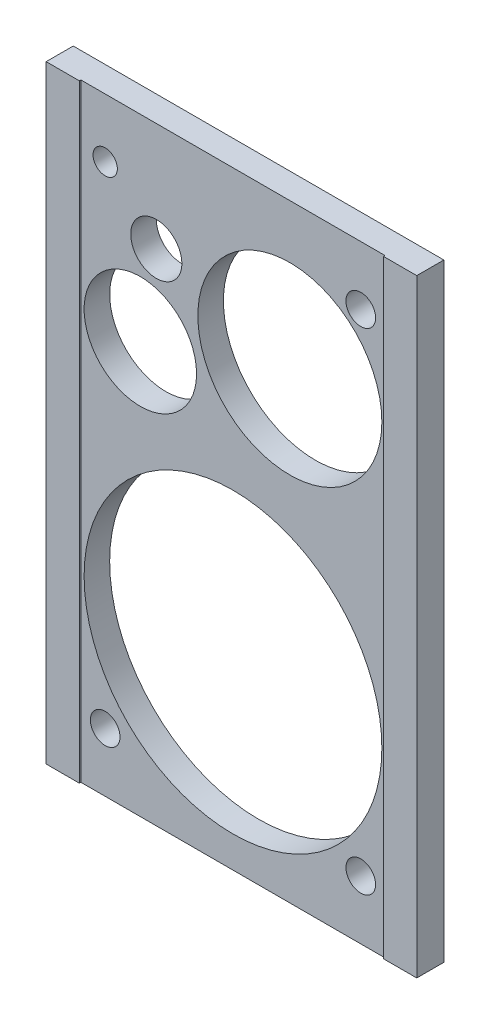
ISO-10303-21;
HEADER;
FILE_DESCRIPTION(('STEP AP214'),'2;1');
FILE_NAME('part.step','',(''),(''),'','','');
FILE_SCHEMA(('AUTOMOTIVE_DESIGN { 1 0 10303 214 1 1 1 1 }'));
ENDSEC;
DATA;
#1=APPLICATION_CONTEXT('core data for automotive mechanical design processes');
#2=APPLICATION_PROTOCOL_DEFINITION('international standard','automotive_design',2000,#1);
#3=PRODUCT_CONTEXT('',#1,'mechanical');
#4=PRODUCT('Part','Part','',(#3));
#5=PRODUCT_RELATED_PRODUCT_CATEGORY('part','',(#4));
#6=PRODUCT_DEFINITION_FORMATION('','',#4);
#7=PRODUCT_DEFINITION_CONTEXT('part definition',#1,'design');
#8=PRODUCT_DEFINITION('design','',#6,#7);
#9=PRODUCT_DEFINITION_SHAPE('','',#8);
#10=(LENGTH_UNIT() NAMED_UNIT(*) SI_UNIT(.MILLI.,.METRE.));
#11=(NAMED_UNIT(*) PLANE_ANGLE_UNIT() SI_UNIT($,.RADIAN.));
#12=(NAMED_UNIT(*) SI_UNIT($,.STERADIAN.) SOLID_ANGLE_UNIT());
#13=UNCERTAINTY_MEASURE_WITH_UNIT(LENGTH_MEASURE(1.E-05),#10,'distance_accuracy_value','');
#14=(GEOMETRIC_REPRESENTATION_CONTEXT(3) GLOBAL_UNCERTAINTY_ASSIGNED_CONTEXT((#13)) GLOBAL_UNIT_ASSIGNED_CONTEXT((#10,
#11,#12)) REPRESENTATION_CONTEXT('',''));
#15=CARTESIAN_POINT('',(0.,0.,0.));
#16=DIRECTION('',(0.,0.,1.));
#17=DIRECTION('',(1.,0.,0.));
#18=AXIS2_PLACEMENT_3D('',#15,#16,#17);
#19=CARTESIAN_POINT('',(0.,0.,10.));
#20=DIRECTION('',(0.,0.,1.));
#21=DIRECTION('',(1.,0.,0.));
#22=AXIS2_PLACEMENT_3D('',#19,#20,#21);
#23=PLANE('',#22);
#24=DIRECTION('',(0.,1.,0.));
#25=VECTOR('',#24,1.);
#26=CARTESIAN_POINT('',(59.5,0.,10.));
#27=LINE('',#26,#25);
#28=CARTESIAN_POINT('',(59.5,-119.,10.));
#29=VERTEX_POINT('',#28);
#30=CARTESIAN_POINT('',(59.5,119.,10.));
#31=VERTEX_POINT('',#30);
#32=EDGE_CURVE('E108',#29,#31,#27,.T.);
#33=ORIENTED_EDGE('',*,*,#32,.T.);
#34=DIRECTION('',(1.,0.,0.));
#35=VECTOR('',#34,1.);
#36=CARTESIAN_POINT('',(0.,119.,10.));
#37=LINE('',#36,#35);
#38=CARTESIAN_POINT('',(-59.5,119.,10.));
#39=VERTEX_POINT('',#38);
#40=EDGE_CURVE('E174',#39,#31,#37,.T.);
#41=ORIENTED_EDGE('',*,*,#40,.F.);
#42=DIRECTION('',(0.,-1.,0.));
#43=VECTOR('',#42,1.);
#44=CARTESIAN_POINT('',(-59.5,0.,10.));
#45=LINE('',#44,#43);
#46=CARTESIAN_POINT('',(-59.5,-119.,10.));
#47=VERTEX_POINT('',#46);
#48=EDGE_CURVE('E111',#39,#47,#45,.T.);
#49=ORIENTED_EDGE('',*,*,#48,.T.);
#50=DIRECTION('',(1.,0.,0.));
#51=VECTOR('',#50,1.);
#52=CARTESIAN_POINT('',(0.,-119.,10.));
#53=LINE('',#52,#51);
#54=EDGE_CURVE('E172',#47,#29,#53,.T.);
#55=ORIENTED_EDGE('',*,*,#54,.T.);
#56=EDGE_LOOP('',(#33,#41,#49,#55));
#57=FACE_BOUND('',#56,.T.);
#58=CARTESIAN_POINT('',(22.25,62.,10.));
#59=DIRECTION('',(0.,0.,1.));
#60=DIRECTION('',(1.,0.,0.));
#61=AXIS2_PLACEMENT_3D('',#58,#59,#60);
#62=CIRCLE('',#61,36.);
#63=CARTESIAN_POINT('',(58.25,62.,10.));
#64=VERTEX_POINT('',#63);
#65=EDGE_CURVE('E147',#64,#64,#62,.T.);
#66=ORIENTED_EDGE('',*,*,#65,.F.);
#67=EDGE_LOOP('',(#66));
#68=FACE_BOUND('',#67,.T.);
#69=CARTESIAN_POINT('',(-36.25,42.,10.));
#70=DIRECTION('',(0.,0.,1.));
#71=DIRECTION('',(1.,0.,0.));
#72=AXIS2_PLACEMENT_3D('',#69,#70,#71);
#73=CIRCLE('',#72,22.);
#74=CARTESIAN_POINT('',(-14.25,42.,10.));
#75=VERTEX_POINT('',#74);
#76=EDGE_CURVE('E150',#75,#75,#73,.T.);
#77=ORIENTED_EDGE('',*,*,#76,.F.);
#78=EDGE_LOOP('',(#77));
#79=FACE_BOUND('',#78,.T.);
#80=CARTESIAN_POINT('',(-50.,96.,10.));
#81=DIRECTION('',(0.,0.,1.));
#82=DIRECTION('',(1.,0.,0.));
#83=AXIS2_PLACEMENT_3D('',#80,#81,#82);
#84=CIRCLE('',#83,4.75);
#85=CARTESIAN_POINT('',(-45.25,96.,10.));
#86=VERTEX_POINT('',#85);
#87=EDGE_CURVE('E154',#86,#86,#84,.T.);
#88=ORIENTED_EDGE('',*,*,#87,.F.);
#89=EDGE_LOOP('',(#88));
#90=FACE_BOUND('',#89,.T.);
#91=CARTESIAN_POINT('',(-30.,76.5,10.));
#92=DIRECTION('',(0.,0.,1.));
#93=DIRECTION('',(1.,0.,0.));
#94=AXIS2_PLACEMENT_3D('',#91,#92,#93);
#95=CIRCLE('',#94,9.99999999999998);
#96=CARTESIAN_POINT('',(-20.,76.5,10.));
#97=VERTEX_POINT('',#96);
#98=EDGE_CURVE('E157',#97,#97,#95,.T.);
#99=ORIENTED_EDGE('',*,*,#98,.F.);
#100=EDGE_LOOP('',(#99));
#101=FACE_BOUND('',#100,.T.);
#102=CARTESIAN_POINT('',(0.,-48.5,10.));
#103=DIRECTION('',(0.,0.,1.));
#104=DIRECTION('',(1.,0.,0.));
#105=AXIS2_PLACEMENT_3D('',#102,#103,#104);
#106=CIRCLE('',#105,58.25);
#107=CARTESIAN_POINT('',(58.25,-48.5,10.));
#108=VERTEX_POINT('',#107);
#109=EDGE_CURVE('E160',#108,#108,#106,.T.);
#110=ORIENTED_EDGE('',*,*,#109,.F.);
#111=EDGE_LOOP('',(#110));
#112=FACE_BOUND('',#111,.T.);
#113=CARTESIAN_POINT('',(-50.,-96.,10.));
#114=DIRECTION('',(0.,0.,1.));
#115=DIRECTION('',(1.,0.,0.));
#116=AXIS2_PLACEMENT_3D('',#113,#114,#115);
#117=CIRCLE('',#116,5.8);
#118=CARTESIAN_POINT('',(-44.2,-96.,10.));
#119=VERTEX_POINT('',#118);
#120=EDGE_CURVE('E163',#119,#119,#117,.T.);
#121=ORIENTED_EDGE('',*,*,#120,.F.);
#122=EDGE_LOOP('',(#121));
#123=FACE_BOUND('',#122,.T.);
#124=CARTESIAN_POINT('',(50.,-96.,10.));
#125=DIRECTION('',(0.,0.,1.));
#126=DIRECTION('',(1.,0.,0.));
#127=AXIS2_PLACEMENT_3D('',#124,#125,#126);
#128=CIRCLE('',#127,5.8);
#129=CARTESIAN_POINT('',(55.8,-96.,10.));
#130=VERTEX_POINT('',#129);
#131=EDGE_CURVE('E166',#130,#130,#128,.T.);
#132=ORIENTED_EDGE('',*,*,#131,.F.);
#133=EDGE_LOOP('',(#132));
#134=FACE_BOUND('',#133,.T.);
#135=CARTESIAN_POINT('',(50.,96.,10.));
#136=DIRECTION('',(0.,0.,1.));
#137=DIRECTION('',(1.,0.,0.));
#138=AXIS2_PLACEMENT_3D('',#135,#136,#137);
#139=CIRCLE('',#138,5.8);
#140=CARTESIAN_POINT('',(55.8,96.,10.));
#141=VERTEX_POINT('',#140);
#142=EDGE_CURVE('E169',#141,#141,#139,.T.);
#143=ORIENTED_EDGE('',*,*,#142,.F.);
#144=EDGE_LOOP('',(#143));
#145=FACE_BOUND('',#144,.T.);
#146=ADVANCED_FACE('F34',(#57,#68,#79,#90,#101,#112,#123,#134,#145),#23,.T.);
#147=CARTESIAN_POINT('',(0.,-119.,10.));
#148=DIRECTION('',(0.,1.,0.));
#149=DIRECTION('',(0.,0.,1.));
#150=AXIS2_PLACEMENT_3D('',#147,#148,#149);
#151=PLANE('',#150);
#152=DIRECTION('',(1.,0.,0.));
#153=VECTOR('',#152,1.);
#154=CARTESIAN_POINT('',(0.,-119.,0.));
#155=LINE('',#154,#153);
#156=CARTESIAN_POINT('',(-72.5,-119.,0.));
#157=VERTEX_POINT('',#156);
#158=CARTESIAN_POINT('',(72.5,-119.,0.));
#159=VERTEX_POINT('',#158);
#160=EDGE_CURVE('E200',#157,#159,#155,.T.);
#161=ORIENTED_EDGE('',*,*,#160,.T.);
#162=DIRECTION('',(0.,0.,-1.));
#163=VECTOR('',#162,1.);
#164=CARTESIAN_POINT('',(72.5,-119.,10.));
#165=LINE('',#164,#163);
#166=CARTESIAN_POINT('',(72.5,-119.,10.6));
#167=VERTEX_POINT('',#166);
#168=EDGE_CURVE('E11',#167,#159,#165,.T.);
#169=ORIENTED_EDGE('',*,*,#168,.F.);
#170=DIRECTION('',(1.,0.,0.));
#171=VECTOR('',#170,1.);
#172=CARTESIAN_POINT('',(0.,-119.,10.6));
#173=LINE('',#172,#171);
#174=CARTESIAN_POINT('',(59.5,-119.,10.6));
#175=VERTEX_POINT('',#174);
#176=EDGE_CURVE('E115',#175,#167,#173,.T.);
#177=ORIENTED_EDGE('',*,*,#176,.F.);
#178=DIRECTION('',(0.,0.,-1.));
#179=VECTOR('',#178,1.);
#180=CARTESIAN_POINT('',(59.5,-119.,10.6));
#181=LINE('',#180,#179);
#182=EDGE_CURVE('E102',#175,#29,#181,.T.);
#183=ORIENTED_EDGE('',*,*,#182,.T.);
#184=ORIENTED_EDGE('',*,*,#54,.F.);
#185=DIRECTION('',(0.,0.,-1.));
#186=VECTOR('',#185,1.);
#187=CARTESIAN_POINT('',(-59.5,-119.,10.6));
#188=LINE('',#187,#186);
#189=CARTESIAN_POINT('',(-59.5,-119.,10.6));
#190=VERTEX_POINT('',#189);
#191=EDGE_CURVE('E49',#190,#47,#188,.T.);
#192=ORIENTED_EDGE('',*,*,#191,.F.);
#193=DIRECTION('',(1.,0.,0.));
#194=VECTOR('',#193,1.);
#195=CARTESIAN_POINT('',(0.,-119.,10.6));
#196=LINE('',#195,#194);
#197=CARTESIAN_POINT('',(-72.5,-119.,10.6));
#198=VERTEX_POINT('',#197);
#199=EDGE_CURVE('E140',#198,#190,#196,.T.);
#200=ORIENTED_EDGE('',*,*,#199,.F.);
#201=DIRECTION('',(0.,0.,-1.));
#202=VECTOR('',#201,1.);
#203=CARTESIAN_POINT('',(-72.5,-119.,10.));
#204=LINE('',#203,#202);
#205=EDGE_CURVE('E57',#198,#157,#204,.T.);
#206=ORIENTED_EDGE('',*,*,#205,.T.);
#207=EDGE_LOOP('',(#161,#169,#177,#183,#184,#192,#200,#206));
#208=FACE_BOUND('',#207,.T.);
#209=ADVANCED_FACE('F116',(#208),#151,.F.);
#210=CARTESIAN_POINT('',(72.5,0.,10.));
#211=DIRECTION('',(-1.,0.,0.));
#212=DIRECTION('',(0.,0.,1.));
#213=AXIS2_PLACEMENT_3D('',#210,#211,#212);
#214=PLANE('',#213);
#215=DIRECTION('',(0.,1.,0.));
#216=VECTOR('',#215,1.);
#217=CARTESIAN_POINT('',(72.5,0.,0.));
#218=LINE('',#217,#216);
#219=CARTESIAN_POINT('',(72.5,119.,0.));
#220=VERTEX_POINT('',#219);
#221=EDGE_CURVE('E202',#159,#220,#218,.T.);
#222=ORIENTED_EDGE('',*,*,#221,.T.);
#223=DIRECTION('',(0.,0.,-1.));
#224=VECTOR('',#223,1.);
#225=CARTESIAN_POINT('',(72.5,119.,10.));
#226=LINE('',#225,#224);
#227=CARTESIAN_POINT('',(72.5,119.,10.6));
#228=VERTEX_POINT('',#227);
#229=EDGE_CURVE('E42',#228,#220,#226,.T.);
#230=ORIENTED_EDGE('',*,*,#229,.F.);
#231=DIRECTION('',(0.,1.,0.));
#232=VECTOR('',#231,1.);
#233=CARTESIAN_POINT('',(72.5,0.,10.6));
#234=LINE('',#233,#232);
#235=EDGE_CURVE('E120',#167,#228,#234,.T.);
#236=ORIENTED_EDGE('',*,*,#235,.F.);
#237=ORIENTED_EDGE('',*,*,#168,.T.);
#238=EDGE_LOOP('',(#222,#230,#236,#237));
#239=FACE_BOUND('',#238,.T.);
#240=ADVANCED_FACE('F216',(#239),#214,.F.);
#241=CARTESIAN_POINT('',(0.,119.,10.));
#242=DIRECTION('',(0.,1.,0.));
#243=DIRECTION('',(0.,0.,1.));
#244=AXIS2_PLACEMENT_3D('',#241,#242,#243);
#245=PLANE('',#244);
#246=DIRECTION('',(1.,0.,0.));
#247=VECTOR('',#246,1.);
#248=CARTESIAN_POINT('',(0.,119.,0.));
#249=LINE('',#248,#247);
#250=CARTESIAN_POINT('',(-72.5,119.,0.));
#251=VERTEX_POINT('',#250);
#252=EDGE_CURVE('E205',#251,#220,#249,.T.);
#253=ORIENTED_EDGE('',*,*,#252,.F.);
#254=DIRECTION('',(0.,0.,-1.));
#255=VECTOR('',#254,1.);
#256=CARTESIAN_POINT('',(-72.5,119.,10.));
#257=LINE('',#256,#255);
#258=CARTESIAN_POINT('',(-72.5,119.,10.6));
#259=VERTEX_POINT('',#258);
#260=EDGE_CURVE('E211',#259,#251,#257,.T.);
#261=ORIENTED_EDGE('',*,*,#260,.F.);
#262=DIRECTION('',(-1.,0.,0.));
#263=VECTOR('',#262,1.);
#264=CARTESIAN_POINT('',(0.,119.,10.6));
#265=LINE('',#264,#263);
#266=CARTESIAN_POINT('',(-59.5,119.,10.6));
#267=VERTEX_POINT('',#266);
#268=EDGE_CURVE('E134',#267,#259,#265,.T.);
#269=ORIENTED_EDGE('',*,*,#268,.F.);
#270=DIRECTION('',(0.,0.,-1.));
#271=VECTOR('',#270,1.);
#272=CARTESIAN_POINT('',(-59.5,119.,10.6));
#273=LINE('',#272,#271);
#274=EDGE_CURVE('E144',#267,#39,#273,.T.);
#275=ORIENTED_EDGE('',*,*,#274,.T.);
#276=ORIENTED_EDGE('',*,*,#40,.T.);
#277=DIRECTION('',(0.,0.,-1.));
#278=VECTOR('',#277,1.);
#279=CARTESIAN_POINT('',(59.5,119.,10.6));
#280=LINE('',#279,#278);
#281=CARTESIAN_POINT('',(59.5,119.,10.6));
#282=VERTEX_POINT('',#281);
#283=EDGE_CURVE('E112',#282,#31,#280,.T.);
#284=ORIENTED_EDGE('',*,*,#283,.F.);
#285=DIRECTION('',(-1.,0.,0.));
#286=VECTOR('',#285,1.);
#287=CARTESIAN_POINT('',(0.,119.,10.6));
#288=LINE('',#287,#286);
#289=EDGE_CURVE('E124',#228,#282,#288,.T.);
#290=ORIENTED_EDGE('',*,*,#289,.F.);
#291=ORIENTED_EDGE('',*,*,#229,.T.);
#292=EDGE_LOOP('',(#253,#261,#269,#275,#276,#284,#290,#291));
#293=FACE_BOUND('',#292,.T.);
#294=ADVANCED_FACE('F214',(#293),#245,.T.);
#295=CARTESIAN_POINT('',(50.,96.,10.));
#296=DIRECTION('',(0.,0.,-1.));
#297=DIRECTION('',(-1.,0.,0.));
#298=AXIS2_PLACEMENT_3D('',#295,#296,#297);
#299=CYLINDRICAL_SURFACE('',#298,5.8);
#300=ORIENTED_EDGE('',*,*,#142,.T.);
#301=EDGE_LOOP('',(#300));
#302=FACE_BOUND('',#301,.T.);
#303=CARTESIAN_POINT('',(50.,96.,0.));
#304=DIRECTION('',(0.,0.,1.));
#305=DIRECTION('',(1.,0.,0.));
#306=AXIS2_PLACEMENT_3D('',#303,#304,#305);
#307=CIRCLE('',#306,5.8);
#308=CARTESIAN_POINT('',(55.8,96.,0.));
#309=VERTEX_POINT('',#308);
#310=EDGE_CURVE('E197',#309,#309,#307,.T.);
#311=ORIENTED_EDGE('',*,*,#310,.F.);
#312=EDGE_LOOP('',(#311));
#313=FACE_BOUND('',#312,.T.);
#314=ADVANCED_FACE('F249',(#302,#313),#299,.F.);
#315=CARTESIAN_POINT('',(50.,-96.,10.));
#316=DIRECTION('',(0.,0.,-1.));
#317=DIRECTION('',(-1.,0.,0.));
#318=AXIS2_PLACEMENT_3D('',#315,#316,#317);
#319=CYLINDRICAL_SURFACE('',#318,5.8);
#320=ORIENTED_EDGE('',*,*,#131,.T.);
#321=EDGE_LOOP('',(#320));
#322=FACE_BOUND('',#321,.T.);
#323=CARTESIAN_POINT('',(50.,-96.,0.));
#324=DIRECTION('',(0.,0.,1.));
#325=DIRECTION('',(1.,0.,0.));
#326=AXIS2_PLACEMENT_3D('',#323,#324,#325);
#327=CIRCLE('',#326,5.8);
#328=CARTESIAN_POINT('',(55.8,-96.,0.));
#329=VERTEX_POINT('',#328);
#330=EDGE_CURVE('E194',#329,#329,#327,.T.);
#331=ORIENTED_EDGE('',*,*,#330,.F.);
#332=EDGE_LOOP('',(#331));
#333=FACE_BOUND('',#332,.T.);
#334=ADVANCED_FACE('F252',(#322,#333),#319,.F.);
#335=CARTESIAN_POINT('',(-50.,-96.,10.));
#336=DIRECTION('',(0.,0.,-1.));
#337=DIRECTION('',(-1.,0.,0.));
#338=AXIS2_PLACEMENT_3D('',#335,#336,#337);
#339=CYLINDRICAL_SURFACE('',#338,5.8);
#340=ORIENTED_EDGE('',*,*,#120,.T.);
#341=EDGE_LOOP('',(#340));
#342=FACE_BOUND('',#341,.T.);
#343=CARTESIAN_POINT('',(-50.,-96.,0.));
#344=DIRECTION('',(0.,0.,1.));
#345=DIRECTION('',(1.,0.,0.));
#346=AXIS2_PLACEMENT_3D('',#343,#344,#345);
#347=CIRCLE('',#346,5.8);
#348=CARTESIAN_POINT('',(-44.2,-96.,0.));
#349=VERTEX_POINT('',#348);
#350=EDGE_CURVE('E191',#349,#349,#347,.T.);
#351=ORIENTED_EDGE('',*,*,#350,.F.);
#352=EDGE_LOOP('',(#351));
#353=FACE_BOUND('',#352,.T.);
#354=ADVANCED_FACE('F275',(#342,#353),#339,.F.);
#355=CARTESIAN_POINT('',(0.,-48.5,10.));
#356=DIRECTION('',(0.,0.,-1.));
#357=DIRECTION('',(-1.,0.,0.));
#358=AXIS2_PLACEMENT_3D('',#355,#356,#357);
#359=CYLINDRICAL_SURFACE('',#358,58.25);
#360=ORIENTED_EDGE('',*,*,#109,.T.);
#361=EDGE_LOOP('',(#360));
#362=FACE_BOUND('',#361,.T.);
#363=CARTESIAN_POINT('',(0.,-48.5,0.));
#364=DIRECTION('',(0.,0.,1.));
#365=DIRECTION('',(1.,0.,0.));
#366=AXIS2_PLACEMENT_3D('',#363,#364,#365);
#367=CIRCLE('',#366,58.25);
#368=CARTESIAN_POINT('',(58.25,-48.5,0.));
#369=VERTEX_POINT('',#368);
#370=EDGE_CURVE('E188',#369,#369,#367,.T.);
#371=ORIENTED_EDGE('',*,*,#370,.F.);
#372=EDGE_LOOP('',(#371));
#373=FACE_BOUND('',#372,.T.);
#374=ADVANCED_FACE('F279',(#362,#373),#359,.F.);
#375=CARTESIAN_POINT('',(-30.,76.5,10.));
#376=DIRECTION('',(0.,0.,-1.));
#377=DIRECTION('',(-1.,0.,0.));
#378=AXIS2_PLACEMENT_3D('',#375,#376,#377);
#379=CYLINDRICAL_SURFACE('',#378,9.99999999999998);
#380=ORIENTED_EDGE('',*,*,#98,.T.);
#381=EDGE_LOOP('',(#380));
#382=FACE_BOUND('',#381,.T.);
#383=CARTESIAN_POINT('',(-30.,76.5,0.));
#384=DIRECTION('',(0.,0.,1.));
#385=DIRECTION('',(1.,0.,0.));
#386=AXIS2_PLACEMENT_3D('',#383,#384,#385);
#387=CIRCLE('',#386,9.99999999999998);
#388=CARTESIAN_POINT('',(-20.,76.5,0.));
#389=VERTEX_POINT('',#388);
#390=EDGE_CURVE('E185',#389,#389,#387,.T.);
#391=ORIENTED_EDGE('',*,*,#390,.F.);
#392=EDGE_LOOP('',(#391));
#393=FACE_BOUND('',#392,.T.);
#394=ADVANCED_FACE('F283',(#382,#393),#379,.F.);
#395=CARTESIAN_POINT('',(-50.,96.,10.));
#396=DIRECTION('',(0.,0.,-1.));
#397=DIRECTION('',(-1.,0.,0.));
#398=AXIS2_PLACEMENT_3D('',#395,#396,#397);
#399=CYLINDRICAL_SURFACE('',#398,4.75);
#400=ORIENTED_EDGE('',*,*,#87,.T.);
#401=EDGE_LOOP('',(#400));
#402=FACE_BOUND('',#401,.T.);
#403=CARTESIAN_POINT('',(-50.,96.,0.));
#404=DIRECTION('',(0.,0.,1.));
#405=DIRECTION('',(1.,0.,0.));
#406=AXIS2_PLACEMENT_3D('',#403,#404,#405);
#407=CIRCLE('',#406,4.75);
#408=CARTESIAN_POINT('',(-45.25,96.,0.));
#409=VERTEX_POINT('',#408);
#410=EDGE_CURVE('E182',#409,#409,#407,.T.);
#411=ORIENTED_EDGE('',*,*,#410,.F.);
#412=EDGE_LOOP('',(#411));
#413=FACE_BOUND('',#412,.T.);
#414=ADVANCED_FACE('F287',(#402,#413),#399,.F.);
#415=CARTESIAN_POINT('',(-36.25,42.,10.));
#416=DIRECTION('',(0.,0.,-1.));
#417=DIRECTION('',(-1.,0.,0.));
#418=AXIS2_PLACEMENT_3D('',#415,#416,#417);
#419=CYLINDRICAL_SURFACE('',#418,22.);
#420=ORIENTED_EDGE('',*,*,#76,.T.);
#421=EDGE_LOOP('',(#420));
#422=FACE_BOUND('',#421,.T.);
#423=CARTESIAN_POINT('',(-36.25,42.,0.));
#424=DIRECTION('',(0.,0.,1.));
#425=DIRECTION('',(1.,0.,0.));
#426=AXIS2_PLACEMENT_3D('',#423,#424,#425);
#427=CIRCLE('',#426,22.);
#428=CARTESIAN_POINT('',(-14.25,42.,0.));
#429=VERTEX_POINT('',#428);
#430=EDGE_CURVE('E179',#429,#429,#427,.T.);
#431=ORIENTED_EDGE('',*,*,#430,.F.);
#432=EDGE_LOOP('',(#431));
#433=FACE_BOUND('',#432,.T.);
#434=ADVANCED_FACE('F290',(#422,#433),#419,.F.);
#435=CARTESIAN_POINT('',(22.25,62.,10.));
#436=DIRECTION('',(0.,0.,-1.));
#437=DIRECTION('',(-1.,0.,0.));
#438=AXIS2_PLACEMENT_3D('',#435,#436,#437);
#439=CYLINDRICAL_SURFACE('',#438,36.);
#440=ORIENTED_EDGE('',*,*,#65,.T.);
#441=EDGE_LOOP('',(#440));
#442=FACE_BOUND('',#441,.T.);
#443=CARTESIAN_POINT('',(22.25,62.,0.));
#444=DIRECTION('',(0.,0.,1.));
#445=DIRECTION('',(1.,0.,0.));
#446=AXIS2_PLACEMENT_3D('',#443,#444,#445);
#447=CIRCLE('',#446,36.);
#448=CARTESIAN_POINT('',(58.25,62.,0.));
#449=VERTEX_POINT('',#448);
#450=EDGE_CURVE('E146',#449,#449,#447,.T.);
#451=ORIENTED_EDGE('',*,*,#450,.F.);
#452=EDGE_LOOP('',(#451));
#453=FACE_BOUND('',#452,.T.);
#454=ADVANCED_FACE('F36',(#442,#453),#439,.F.);
#455=CARTESIAN_POINT('',(-72.5,0.,10.));
#456=DIRECTION('',(-1.,0.,0.));
#457=DIRECTION('',(0.,0.,1.));
#458=AXIS2_PLACEMENT_3D('',#455,#456,#457);
#459=PLANE('',#458);
#460=DIRECTION('',(0.,1.,0.));
#461=VECTOR('',#460,1.);
#462=CARTESIAN_POINT('',(-72.5,0.,0.));
#463=LINE('',#462,#461);
#464=EDGE_CURVE('E151',#157,#251,#463,.T.);
#465=ORIENTED_EDGE('',*,*,#464,.F.);
#466=ORIENTED_EDGE('',*,*,#205,.F.);
#467=DIRECTION('',(0.,-1.,0.));
#468=VECTOR('',#467,1.);
#469=CARTESIAN_POINT('',(-72.5,0.,10.6));
#470=LINE('',#469,#468);
#471=EDGE_CURVE('E137',#259,#198,#470,.T.);
#472=ORIENTED_EDGE('',*,*,#471,.F.);
#473=ORIENTED_EDGE('',*,*,#260,.T.);
#474=EDGE_LOOP('',(#465,#466,#472,#473));
#475=FACE_BOUND('',#474,.T.);
#476=ADVANCED_FACE('F221',(#475),#459,.T.);
#477=CARTESIAN_POINT('',(0.,0.,0.));
#478=DIRECTION('',(0.,0.,1.));
#479=DIRECTION('',(1.,0.,0.));
#480=AXIS2_PLACEMENT_3D('',#477,#478,#479);
#481=PLANE('',#480);
#482=ORIENTED_EDGE('',*,*,#450,.T.);
#483=EDGE_LOOP('',(#482));
#484=FACE_BOUND('',#483,.T.);
#485=ORIENTED_EDGE('',*,*,#430,.T.);
#486=EDGE_LOOP('',(#485));
#487=FACE_BOUND('',#486,.T.);
#488=ORIENTED_EDGE('',*,*,#410,.T.);
#489=EDGE_LOOP('',(#488));
#490=FACE_BOUND('',#489,.T.);
#491=ORIENTED_EDGE('',*,*,#390,.T.);
#492=EDGE_LOOP('',(#491));
#493=FACE_BOUND('',#492,.T.);
#494=ORIENTED_EDGE('',*,*,#370,.T.);
#495=EDGE_LOOP('',(#494));
#496=FACE_BOUND('',#495,.T.);
#497=ORIENTED_EDGE('',*,*,#350,.T.);
#498=EDGE_LOOP('',(#497));
#499=FACE_BOUND('',#498,.T.);
#500=ORIENTED_EDGE('',*,*,#330,.T.);
#501=EDGE_LOOP('',(#500));
#502=FACE_BOUND('',#501,.T.);
#503=ORIENTED_EDGE('',*,*,#310,.T.);
#504=EDGE_LOOP('',(#503));
#505=FACE_BOUND('',#504,.T.);
#506=ORIENTED_EDGE('',*,*,#160,.F.);
#507=ORIENTED_EDGE('',*,*,#464,.T.);
#508=ORIENTED_EDGE('',*,*,#252,.T.);
#509=ORIENTED_EDGE('',*,*,#221,.F.);
#510=EDGE_LOOP('',(#506,#507,#508,#509));
#511=FACE_BOUND('',#510,.T.);
#512=ADVANCED_FACE('F218',(#484,#487,#490,#493,#496,#499,#502,#505,#511),#481,.F.);
#513=CARTESIAN_POINT('',(-59.5,0.,10.6));
#514=DIRECTION('',(1.,0.,0.));
#515=DIRECTION('',(0.,1.,0.));
#516=AXIS2_PLACEMENT_3D('',#513,#514,#515);
#517=PLANE('',#516);
#518=ORIENTED_EDGE('',*,*,#48,.F.);
#519=ORIENTED_EDGE('',*,*,#274,.F.);
#520=DIRECTION('',(0.,-1.,0.));
#521=VECTOR('',#520,1.);
#522=CARTESIAN_POINT('',(-59.5,0.,10.6));
#523=LINE('',#522,#521);
#524=EDGE_CURVE('E132',#267,#190,#523,.T.);
#525=ORIENTED_EDGE('',*,*,#524,.T.);
#526=ORIENTED_EDGE('',*,*,#191,.T.);
#527=EDGE_LOOP('',(#518,#519,#525,#526));
#528=FACE_BOUND('',#527,.T.);
#529=ADVANCED_FACE('F227',(#528),#517,.T.);
#530=CARTESIAN_POINT('',(0.,0.,10.6));
#531=DIRECTION('',(0.,0.,1.));
#532=DIRECTION('',(1.,0.,0.));
#533=AXIS2_PLACEMENT_3D('',#530,#531,#532);
#534=PLANE('',#533);
#535=ORIENTED_EDGE('',*,*,#524,.F.);
#536=ORIENTED_EDGE('',*,*,#268,.T.);
#537=ORIENTED_EDGE('',*,*,#471,.T.);
#538=ORIENTED_EDGE('',*,*,#199,.T.);
#539=EDGE_LOOP('',(#535,#536,#537,#538));
#540=FACE_BOUND('',#539,.T.);
#541=ADVANCED_FACE('F226',(#540),#534,.T.);
#542=CARTESIAN_POINT('',(59.5,0.,10.6));
#543=DIRECTION('',(-1.,0.,0.));
#544=DIRECTION('',(0.,0.,1.));
#545=AXIS2_PLACEMENT_3D('',#542,#543,#544);
#546=PLANE('',#545);
#547=ORIENTED_EDGE('',*,*,#32,.F.);
#548=ORIENTED_EDGE('',*,*,#182,.F.);
#549=DIRECTION('',(0.,1.,0.));
#550=VECTOR('',#549,1.);
#551=CARTESIAN_POINT('',(59.5,0.,10.6));
#552=LINE('',#551,#550);
#553=EDGE_CURVE('E106',#175,#282,#552,.T.);
#554=ORIENTED_EDGE('',*,*,#553,.T.);
#555=ORIENTED_EDGE('',*,*,#283,.T.);
#556=EDGE_LOOP('',(#547,#548,#554,#555));
#557=FACE_BOUND('',#556,.T.);
#558=ADVANCED_FACE('F104',(#557),#546,.T.);
#559=CARTESIAN_POINT('',(0.,0.,10.6));
#560=DIRECTION('',(0.,0.,1.));
#561=DIRECTION('',(1.,0.,0.));
#562=AXIS2_PLACEMENT_3D('',#559,#560,#561);
#563=PLANE('',#562);
#564=ORIENTED_EDGE('',*,*,#553,.F.);
#565=ORIENTED_EDGE('',*,*,#176,.T.);
#566=ORIENTED_EDGE('',*,*,#235,.T.);
#567=ORIENTED_EDGE('',*,*,#289,.T.);
#568=EDGE_LOOP('',(#564,#565,#566,#567));
#569=FACE_BOUND('',#568,.T.);
#570=ADVANCED_FACE('F122',(#569),#563,.T.);
#571=CLOSED_SHELL('',(#146,#209,#240,#294,#314,#334,#354,#374,#394,#414,#434,#454,#476,#512,
#529,#541,#558,#570));
#572=MANIFOLD_SOLID_BREP('B2',#571);
#573=ADVANCED_BREP_SHAPE_REPRESENTATION('',(#18,#572),#14);
#574=SHAPE_DEFINITION_REPRESENTATION(#9,#573);
ENDSEC;
END-ISO-10303-21;
